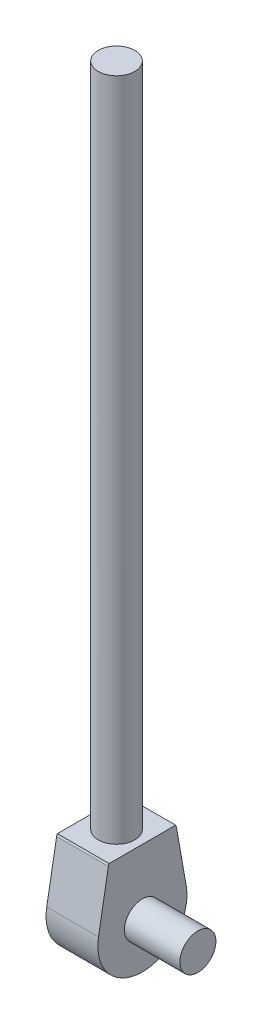
ISO-10303-21;
HEADER;
FILE_DESCRIPTION(('STEP AP214'),'2;1');
FILE_NAME('part.step','',(''),(''),'','','');
FILE_SCHEMA(('AUTOMOTIVE_DESIGN { 1 0 10303 214 1 1 1 1 }'));
ENDSEC;
DATA;
#1=APPLICATION_CONTEXT('core data for automotive mechanical design processes');
#2=APPLICATION_PROTOCOL_DEFINITION('international standard','automotive_design',2000,#1);
#3=PRODUCT_CONTEXT('',#1,'mechanical');
#4=PRODUCT('Part','Part','',(#3));
#5=PRODUCT_RELATED_PRODUCT_CATEGORY('part','',(#4));
#6=PRODUCT_DEFINITION_FORMATION('','',#4);
#7=PRODUCT_DEFINITION_CONTEXT('part definition',#1,'design');
#8=PRODUCT_DEFINITION('design','',#6,#7);
#9=PRODUCT_DEFINITION_SHAPE('','',#8);
#10=(LENGTH_UNIT() NAMED_UNIT(*) SI_UNIT(.MILLI.,.METRE.));
#11=(NAMED_UNIT(*) PLANE_ANGLE_UNIT() SI_UNIT($,.RADIAN.));
#12=(NAMED_UNIT(*) SI_UNIT($,.STERADIAN.) SOLID_ANGLE_UNIT());
#13=UNCERTAINTY_MEASURE_WITH_UNIT(LENGTH_MEASURE(1.E-05),#10,'distance_accuracy_value','');
#14=(GEOMETRIC_REPRESENTATION_CONTEXT(3) GLOBAL_UNCERTAINTY_ASSIGNED_CONTEXT((#13)) GLOBAL_UNIT_ASSIGNED_CONTEXT((#10,
#11,#12)) REPRESENTATION_CONTEXT('',''));
#15=CARTESIAN_POINT('',(0.,0.,0.));
#16=DIRECTION('',(0.,0.,1.));
#17=DIRECTION('',(1.,0.,0.));
#18=AXIS2_PLACEMENT_3D('',#15,#16,#17);
#19=CARTESIAN_POINT('',(28.448,68.197598469496,-30.476750364244));
#20=DIRECTION('',(1.,0.,0.));
#21=DIRECTION('',(0.,0.,-1.));
#22=AXIS2_PLACEMENT_3D('',#19,#20,#21);
#23=PLANE('',#22);
#24=CARTESIAN_POINT('',(28.448,68.197598469496,-30.476750364244));
#25=DIRECTION('',(1.,0.,0.));
#26=DIRECTION('',(0.,0.,-1.));
#27=AXIS2_PLACEMENT_3D('',#24,#25,#26);
#28=CIRCLE('',#27,6.99999342384137);
#29=CARTESIAN_POINT('',(28.448,69.4136344400604,-37.3703100000284));
#30=VERTEX_POINT('',#29);
#31=CARTESIAN_POINT('',(28.448,71.6975986067716,-36.5389205179838));
#32=VERTEX_POINT('',#31);
#33=EDGE_CURVE('E125',#30,#32,#28,.T.);
#34=ORIENTED_EDGE('',*,*,#33,.T.);
#35=DIRECTION('',(0.,-3.33665997890797E-08,0.999999999999999));
#36=VECTOR('',#35,1.);
#37=CARTESIAN_POINT('',(28.448,71.6975986067716,-36.5389205179838));
#38=LINE('',#37,#36);
#39=CARTESIAN_POINT('',(28.448,71.6975961684128,36.5389137108707));
#40=VERTEX_POINT('',#39);
#41=EDGE_CURVE('E92',#32,#40,#38,.T.);
#42=ORIENTED_EDGE('',*,*,#41,.T.);
#43=CARTESIAN_POINT('',(28.448,68.1975940143631,30.4767151086205));
#44=DIRECTION('',(1.,0.,0.));
#45=DIRECTION('',(0.,0.,1.));
#46=AXIS2_PLACEMENT_3D('',#43,#44,#45);
#47=CIRCLE('',#46,7.00001906936523);
#48=CARTESIAN_POINT('',(28.448,69.4136344400604,37.3702999999921));
#49=VERTEX_POINT('',#48);
#50=EDGE_CURVE('E128',#40,#49,#47,.T.);
#51=ORIENTED_EDGE('',*,*,#50,.T.);
#52=DIRECTION('',(0.,-0.984795158850432,0.173719587567873));
#53=VECTOR('',#52,1.);
#54=CARTESIAN_POINT('',(28.448,69.4136344400604,37.3702999999921));
#55=LINE('',#54,#53);
#56=CARTESIAN_POINT('',(28.448,7.7361844400592,48.250309999986));
#57=VERTEX_POINT('',#56);
#58=EDGE_CURVE('E130',#49,#57,#55,.T.);
#59=ORIENTED_EDGE('',*,*,#58,.T.);
#60=CARTESIAN_POINT('',(28.448,-0.775255473600311,-5.00000396641553E-06));
#61=DIRECTION('',(1.,0.,0.));
#62=DIRECTION('',(0.,0.,1.));
#63=AXIS2_PLACEMENT_3D('',#60,#61,#62);
#64=CIRCLE('',#63,48.9952804564082);
#65=CARTESIAN_POINT('',(28.448,7.73618444003764,-48.2503199999978));
#66=VERTEX_POINT('',#65);
#67=EDGE_CURVE('E54',#57,#66,#64,.T.);
#68=ORIENTED_EDGE('',*,*,#67,.T.);
#69=DIRECTION('',(0.,0.98479515885051,0.173719587567433));
#70=VECTOR('',#69,1.);
#71=CARTESIAN_POINT('',(28.448,69.4136344400604,-37.3703100000284));
#72=LINE('',#71,#70);
#73=EDGE_CURVE('E49',#66,#30,#72,.T.);
#74=ORIENTED_EDGE('',*,*,#73,.T.);
#75=EDGE_LOOP('',(#34,#42,#51,#59,#68,#74));
#76=FACE_BOUND('',#75,.T.);
#77=CARTESIAN_POINT('',(28.448,0.,0.));
#78=DIRECTION('',(1.,0.,0.));
#79=DIRECTION('',(0.,0.,-1.));
#80=AXIS2_PLACEMENT_3D('',#77,#78,#79);
#81=CIRCLE('',#80,19.812);
#82=CARTESIAN_POINT('',(28.448,0.,-19.812));
#83=VERTEX_POINT('',#82);
#84=EDGE_CURVE('E199',#83,#83,#81,.T.);
#85=ORIENTED_EDGE('',*,*,#84,.F.);
#86=EDGE_LOOP('',(#85));
#87=FACE_BOUND('',#86,.T.);
#88=ADVANCED_FACE('F33',(#76,#87),#23,.T.);
#89=CARTESIAN_POINT('',(28.448,71.6975986067716,-36.5389205179838));
#90=DIRECTION('',(0.,-0.999999999999999,-3.33665997890797E-08));
#91=DIRECTION('',(0.,3.33665997890797E-08,-0.999999999999999));
#92=AXIS2_PLACEMENT_3D('',#89,#90,#91);
#93=PLANE('',#92);
#94=DIRECTION('',(-1.,0.,0.));
#95=VECTOR('',#94,1.);
#96=CARTESIAN_POINT('',(28.448,71.6975986067716,-36.5389205179838));
#97=LINE('',#96,#95);
#98=CARTESIAN_POINT('',(-28.448,71.6975986067716,-36.5389205179838));
#99=VERTEX_POINT('',#98);
#100=EDGE_CURVE('E42',#32,#99,#97,.T.);
#101=ORIENTED_EDGE('',*,*,#100,.T.);
#102=DIRECTION('',(0.,-3.33665997890797E-08,0.999999999999999));
#103=VECTOR('',#102,1.);
#104=CARTESIAN_POINT('',(-28.448,71.6975986067716,-36.5389205179838));
#105=LINE('',#104,#103);
#106=CARTESIAN_POINT('',(-28.448,71.6975961684128,36.5389137108707));
#107=VERTEX_POINT('',#106);
#108=EDGE_CURVE('E91',#99,#107,#105,.T.);
#109=ORIENTED_EDGE('',*,*,#108,.T.);
#110=DIRECTION('',(-1.,0.,0.));
#111=VECTOR('',#110,1.);
#112=CARTESIAN_POINT('',(28.448,71.6975961684128,36.5389137108707));
#113=LINE('',#112,#111);
#114=EDGE_CURVE('E96',#40,#107,#113,.T.);
#115=ORIENTED_EDGE('',*,*,#114,.F.);
#116=ORIENTED_EDGE('',*,*,#41,.F.);
#117=EDGE_LOOP('',(#101,#109,#115,#116));
#118=FACE_BOUND('',#117,.T.);
#119=CARTESIAN_POINT('',(0.,71.697597387592,2.39230503787035E-06));
#120=DIRECTION('',(0.,-0.999999999999999,-3.33665997890797E-08));
#121=DIRECTION('',(0.,3.33665997890797E-08,-0.999999999999999));
#122=AXIS2_PLACEMENT_3D('',#119,#120,#121);
#123=CIRCLE('',#122,20.066);
#124=CARTESIAN_POINT('',(0.,71.6975980571262,-20.065997607695));
#125=VERTEX_POINT('',#124);
#126=EDGE_CURVE('E11',#125,#125,#123,.F.);
#127=ORIENTED_EDGE('',*,*,#126,.F.);
#128=EDGE_LOOP('',(#127));
#129=FACE_BOUND('',#128,.T.);
#130=ADVANCED_FACE('F88',(#118,#129),#93,.F.);
#131=CARTESIAN_POINT('',(28.448,68.197598469496,-30.476750364244));
#132=DIRECTION('',(-1.,0.,0.));
#133=DIRECTION('',(0.,0.,1.));
#134=AXIS2_PLACEMENT_3D('',#131,#132,#133);
#135=CYLINDRICAL_SURFACE('',#134,6.99999342384137);
#136=DIRECTION('',(-1.,0.,0.));
#137=VECTOR('',#136,1.);
#138=CARTESIAN_POINT('',(28.448,69.4136344400604,-37.3703100000284));
#139=LINE('',#138,#137);
#140=CARTESIAN_POINT('',(-28.448,69.4136344400604,-37.3703100000284));
#141=VERTEX_POINT('',#140);
#142=EDGE_CURVE('E109',#30,#141,#139,.T.);
#143=ORIENTED_EDGE('',*,*,#142,.T.);
#144=CARTESIAN_POINT('',(-28.448,68.197598469496,-30.476750364244));
#145=DIRECTION('',(1.,0.,0.));
#146=DIRECTION('',(0.,0.,-1.));
#147=AXIS2_PLACEMENT_3D('',#144,#145,#146);
#148=CIRCLE('',#147,6.99999342384137);
#149=EDGE_CURVE('E103',#141,#99,#148,.T.);
#150=ORIENTED_EDGE('',*,*,#149,.T.);
#151=ORIENTED_EDGE('',*,*,#100,.F.);
#152=ORIENTED_EDGE('',*,*,#33,.F.);
#153=EDGE_LOOP('',(#143,#150,#151,#152));
#154=FACE_BOUND('',#153,.T.);
#155=ADVANCED_FACE('F35',(#154),#135,.T.);
#156=CARTESIAN_POINT('',(28.448,68.1975940143631,30.4767151086205));
#157=DIRECTION('',(-1.,0.,0.));
#158=DIRECTION('',(0.,0.,1.));
#159=AXIS2_PLACEMENT_3D('',#156,#157,#158);
#160=CYLINDRICAL_SURFACE('',#159,7.00001906936523);
#161=ORIENTED_EDGE('',*,*,#114,.T.);
#162=CARTESIAN_POINT('',(-28.448,68.1975940143631,30.4767151086205));
#163=DIRECTION('',(1.,0.,0.));
#164=DIRECTION('',(0.,0.,1.));
#165=AXIS2_PLACEMENT_3D('',#162,#163,#164);
#166=CIRCLE('',#165,7.00001906936523);
#167=CARTESIAN_POINT('',(-28.448,69.4136344400604,37.3702999999921));
#168=VERTEX_POINT('',#167);
#169=EDGE_CURVE('E107',#107,#168,#166,.T.);
#170=ORIENTED_EDGE('',*,*,#169,.T.);
#171=DIRECTION('',(-1.,0.,0.));
#172=VECTOR('',#171,1.);
#173=CARTESIAN_POINT('',(28.448,69.4136344400604,37.3702999999921));
#174=LINE('',#173,#172);
#175=EDGE_CURVE('E139',#49,#168,#174,.T.);
#176=ORIENTED_EDGE('',*,*,#175,.F.);
#177=ORIENTED_EDGE('',*,*,#50,.F.);
#178=EDGE_LOOP('',(#161,#170,#176,#177));
#179=FACE_BOUND('',#178,.T.);
#180=ADVANCED_FACE('F143',(#179),#160,.T.);
#181=CARTESIAN_POINT('',(28.448,69.4136344400604,37.3702999999921));
#182=DIRECTION('',(0.,-0.173719587567873,-0.984795158850432));
#183=DIRECTION('',(0.,0.984795158850432,-0.173719587567873));
#184=AXIS2_PLACEMENT_3D('',#181,#182,#183);
#185=PLANE('',#184);
#186=ORIENTED_EDGE('',*,*,#175,.T.);
#187=DIRECTION('',(0.,-0.984795158850432,0.173719587567873));
#188=VECTOR('',#187,1.);
#189=CARTESIAN_POINT('',(-28.448,69.4136344400604,37.3702999999921));
#190=LINE('',#189,#188);
#191=CARTESIAN_POINT('',(-28.448,7.7361844400592,48.250309999986));
#192=VERTEX_POINT('',#191);
#193=EDGE_CURVE('E117',#168,#192,#190,.T.);
#194=ORIENTED_EDGE('',*,*,#193,.T.);
#195=DIRECTION('',(-1.,0.,0.));
#196=VECTOR('',#195,1.);
#197=CARTESIAN_POINT('',(28.448,7.7361844400592,48.250309999986));
#198=LINE('',#197,#196);
#199=EDGE_CURVE('E137',#57,#192,#198,.T.);
#200=ORIENTED_EDGE('',*,*,#199,.F.);
#201=ORIENTED_EDGE('',*,*,#58,.F.);
#202=EDGE_LOOP('',(#186,#194,#200,#201));
#203=FACE_BOUND('',#202,.T.);
#204=ADVANCED_FACE('F149',(#203),#185,.F.);
#205=CARTESIAN_POINT('',(28.448,-0.775255473600311,-5.00000396641553E-06));
#206=DIRECTION('',(-1.,0.,0.));
#207=DIRECTION('',(0.,0.,1.));
#208=AXIS2_PLACEMENT_3D('',#205,#206,#207);
#209=CYLINDRICAL_SURFACE('',#208,48.9952804564082);
#210=ORIENTED_EDGE('',*,*,#199,.T.);
#211=CARTESIAN_POINT('',(-28.448,-0.775255473600311,-5.00000396641553E-06));
#212=DIRECTION('',(1.,0.,0.));
#213=DIRECTION('',(0.,0.,1.));
#214=AXIS2_PLACEMENT_3D('',#211,#212,#213);
#215=CIRCLE('',#214,48.9952804564082);
#216=CARTESIAN_POINT('',(-28.448,7.73618444003764,-48.2503199999978));
#217=VERTEX_POINT('',#216);
#218=EDGE_CURVE('E120',#192,#217,#215,.T.);
#219=ORIENTED_EDGE('',*,*,#218,.T.);
#220=DIRECTION('',(-1.,0.,0.));
#221=VECTOR('',#220,1.);
#222=CARTESIAN_POINT('',(28.448,7.73618444003764,-48.2503199999978));
#223=LINE('',#222,#221);
#224=EDGE_CURVE('E135',#66,#217,#223,.T.);
#225=ORIENTED_EDGE('',*,*,#224,.F.);
#226=ORIENTED_EDGE('',*,*,#67,.F.);
#227=EDGE_LOOP('',(#210,#219,#225,#226));
#228=FACE_BOUND('',#227,.T.);
#229=ADVANCED_FACE('F152',(#228),#209,.T.);
#230=CARTESIAN_POINT('',(28.448,69.4136344400604,-37.3703100000284));
#231=DIRECTION('',(0.,-0.173719587567433,0.98479515885051));
#232=DIRECTION('',(0.,-0.98479515885051,-0.173719587567433));
#233=AXIS2_PLACEMENT_3D('',#230,#231,#232);
#234=PLANE('',#233);
#235=ORIENTED_EDGE('',*,*,#224,.T.);
#236=DIRECTION('',(0.,0.98479515885051,0.173719587567433));
#237=VECTOR('',#236,1.);
#238=CARTESIAN_POINT('',(-28.448,69.4136344400604,-37.3703100000284));
#239=LINE('',#238,#237);
#240=EDGE_CURVE('E123',#217,#141,#239,.T.);
#241=ORIENTED_EDGE('',*,*,#240,.T.);
#242=ORIENTED_EDGE('',*,*,#142,.F.);
#243=ORIENTED_EDGE('',*,*,#73,.F.);
#244=EDGE_LOOP('',(#235,#241,#242,#243));
#245=FACE_BOUND('',#244,.T.);
#246=ADVANCED_FACE('F154',(#245),#234,.F.);
#247=CARTESIAN_POINT('',(-28.448,68.197598469496,-30.476750364244));
#248=DIRECTION('',(1.,0.,0.));
#249=DIRECTION('',(0.,0.,-1.));
#250=AXIS2_PLACEMENT_3D('',#247,#248,#249);
#251=PLANE('',#250);
#252=CARTESIAN_POINT('',(-28.448,0.,0.));
#253=DIRECTION('',(1.,0.,0.));
#254=DIRECTION('',(0.,0.,-1.));
#255=AXIS2_PLACEMENT_3D('',#252,#253,#254);
#256=CIRCLE('',#255,34.1737826455291);
#257=CARTESIAN_POINT('',(-28.448,0.,-34.1737826455291));
#258=VERTEX_POINT('',#257);
#259=EDGE_CURVE('E37',#258,#258,#256,.T.);
#260=ORIENTED_EDGE('',*,*,#259,.T.);
#261=EDGE_LOOP('',(#260));
#262=FACE_BOUND('',#261,.T.);
#263=ORIENTED_EDGE('',*,*,#149,.F.);
#264=ORIENTED_EDGE('',*,*,#240,.F.);
#265=ORIENTED_EDGE('',*,*,#218,.F.);
#266=ORIENTED_EDGE('',*,*,#193,.F.);
#267=ORIENTED_EDGE('',*,*,#169,.F.);
#268=ORIENTED_EDGE('',*,*,#108,.F.);
#269=EDGE_LOOP('',(#263,#264,#265,#266,#267,#268));
#270=FACE_BOUND('',#269,.T.);
#271=ADVANCED_FACE('F101',(#262,#270),#251,.F.);
#272=CARTESIAN_POINT('',(0.,803.090597387592,2.67964025574047E-05));
#273=DIRECTION('',(0.,-0.999999999999999,-3.33665997890797E-08));
#274=DIRECTION('',(0.,3.33665997890797E-08,-1.));
#275=AXIS2_PLACEMENT_3D('',#272,#273,#274);
#276=CYLINDRICAL_SURFACE('',#275,20.066);
#277=CARTESIAN_POINT('',(0.,803.090597387592,2.67964025574047E-05));
#278=DIRECTION('',(0.,1.,3.33665997890797E-08));
#279=DIRECTION('',(0.,-3.33665997890797E-08,1.));
#280=AXIS2_PLACEMENT_3D('',#277,#278,#279);
#281=CIRCLE('',#280,20.066);
#282=CARTESIAN_POINT('',(0.,803.090596718057,20.0660267964026));
#283=VERTEX_POINT('',#282);
#284=EDGE_CURVE('E110',#283,#283,#281,.T.);
#285=ORIENTED_EDGE('',*,*,#284,.F.);
#286=EDGE_LOOP('',(#285));
#287=FACE_BOUND('',#286,.T.);
#288=ORIENTED_EDGE('',*,*,#126,.T.);
#289=EDGE_LOOP('',(#288));
#290=FACE_BOUND('',#289,.T.);
#291=ADVANCED_FACE('F161',(#287,#290),#276,.T.);
#292=CARTESIAN_POINT('',(0.,803.090597387592,2.67964025574047E-05));
#293=DIRECTION('',(0.,1.,3.33665997890797E-08));
#294=DIRECTION('',(0.,-3.33665997890797E-08,1.));
#295=AXIS2_PLACEMENT_3D('',#292,#293,#294);
#296=PLANE('',#295);
#297=ORIENTED_EDGE('',*,*,#284,.T.);
#298=EDGE_LOOP('',(#297));
#299=FACE_BOUND('',#298,.T.);
#300=ADVANCED_FACE('F173',(#299),#296,.T.);
#301=CARTESIAN_POINT('',(-32.512,0.,0.));
#302=DIRECTION('',(1.,0.,0.));
#303=DIRECTION('',(0.,0.,-1.));
#304=AXIS2_PLACEMENT_3D('',#301,#302,#303);
#305=CYLINDRICAL_SURFACE('',#304,34.1737826455291);
#306=CARTESIAN_POINT('',(-32.512,0.,0.));
#307=DIRECTION('',(1.,0.,0.));
#308=DIRECTION('',(0.,0.,-1.));
#309=AXIS2_PLACEMENT_3D('',#306,#307,#308);
#310=CIRCLE('',#309,34.1737826455291);
#311=CARTESIAN_POINT('',(-32.512,0.,-34.1737826455291));
#312=VERTEX_POINT('',#311);
#313=EDGE_CURVE('E198',#312,#312,#310,.T.);
#314=ORIENTED_EDGE('',*,*,#313,.T.);
#315=EDGE_LOOP('',(#314));
#316=FACE_BOUND('',#315,.T.);
#317=ORIENTED_EDGE('',*,*,#259,.F.);
#318=EDGE_LOOP('',(#317));
#319=FACE_BOUND('',#318,.T.);
#320=ADVANCED_FACE('F177',(#316,#319),#305,.T.);
#321=CARTESIAN_POINT('',(-32.512,0.,0.));
#322=DIRECTION('',(1.,0.,0.));
#323=DIRECTION('',(0.,0.,-1.));
#324=AXIS2_PLACEMENT_3D('',#321,#322,#323);
#325=PLANE('',#324);
#326=ORIENTED_EDGE('',*,*,#313,.F.);
#327=EDGE_LOOP('',(#326));
#328=FACE_BOUND('',#327,.T.);
#329=ADVANCED_FACE('F181',(#328),#325,.F.);
#330=CARTESIAN_POINT('',(89.408,0.,0.));
#331=DIRECTION('',(-1.,0.,0.));
#332=DIRECTION('',(0.,0.,1.));
#333=AXIS2_PLACEMENT_3D('',#330,#331,#332);
#334=CYLINDRICAL_SURFACE('',#333,19.812);
#335=CARTESIAN_POINT('',(89.408,0.,0.));
#336=DIRECTION('',(1.,0.,0.));
#337=DIRECTION('',(0.,0.,-1.));
#338=AXIS2_PLACEMENT_3D('',#335,#336,#337);
#339=CIRCLE('',#338,19.812);
#340=CARTESIAN_POINT('',(89.408,0.,-19.812));
#341=VERTEX_POINT('',#340);
#342=EDGE_CURVE('E197',#341,#341,#339,.T.);
#343=ORIENTED_EDGE('',*,*,#342,.F.);
#344=EDGE_LOOP('',(#343));
#345=FACE_BOUND('',#344,.T.);
#346=ORIENTED_EDGE('',*,*,#84,.T.);
#347=EDGE_LOOP('',(#346));
#348=FACE_BOUND('',#347,.T.);
#349=ADVANCED_FACE('F185',(#345,#348),#334,.T.);
#350=CARTESIAN_POINT('',(89.408,0.,0.));
#351=DIRECTION('',(1.,0.,0.));
#352=DIRECTION('',(0.,0.,-1.));
#353=AXIS2_PLACEMENT_3D('',#350,#351,#352);
#354=PLANE('',#353);
#355=ORIENTED_EDGE('',*,*,#342,.T.);
#356=EDGE_LOOP('',(#355));
#357=FACE_BOUND('',#356,.T.);
#358=ADVANCED_FACE('F189',(#357),#354,.T.);
#359=CLOSED_SHELL('',(#88,#130,#155,#180,#204,#229,#246,#271,#291,#300,#320,#329,#349,#358));
#360=MANIFOLD_SOLID_BREP('B2',#359);
#361=ADVANCED_BREP_SHAPE_REPRESENTATION('',(#18,#360),#14);
#362=SHAPE_DEFINITION_REPRESENTATION(#9,#361);
ENDSEC;
END-ISO-10303-21;
